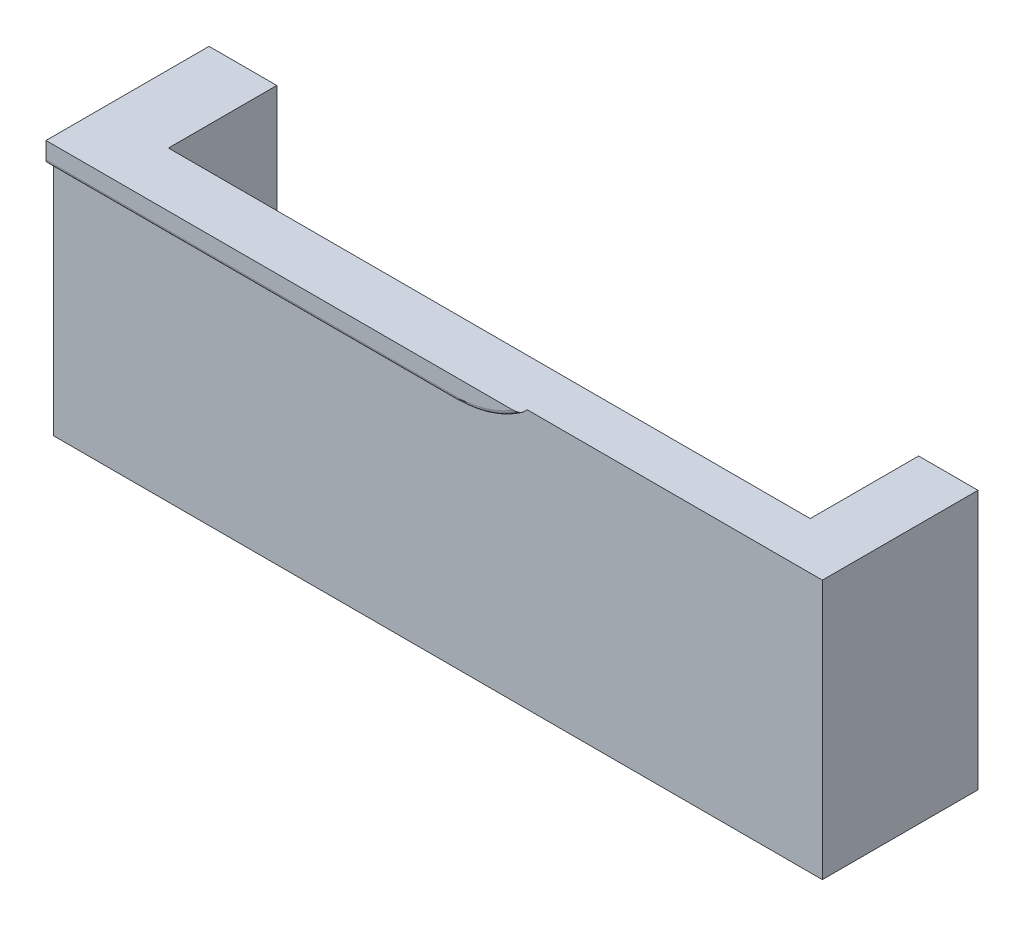
ISO-10303-21;
HEADER;
FILE_DESCRIPTION(('STEP AP214'),'2;1');
FILE_NAME('part.step','',(''),(''),'','','');
FILE_SCHEMA(('AUTOMOTIVE_DESIGN { 1 0 10303 214 1 1 1 1 }'));
ENDSEC;
DATA;
#1=APPLICATION_CONTEXT('core data for automotive mechanical design processes');
#2=APPLICATION_PROTOCOL_DEFINITION('international standard','automotive_design',2000,#1);
#3=PRODUCT_CONTEXT('',#1,'mechanical');
#4=PRODUCT('Part','Part','',(#3));
#5=PRODUCT_RELATED_PRODUCT_CATEGORY('part','',(#4));
#6=PRODUCT_DEFINITION_FORMATION('','',#4);
#7=PRODUCT_DEFINITION_CONTEXT('part definition',#1,'design');
#8=PRODUCT_DEFINITION('design','',#6,#7);
#9=PRODUCT_DEFINITION_SHAPE('','',#8);
#10=(LENGTH_UNIT() NAMED_UNIT(*) SI_UNIT(.MILLI.,.METRE.));
#11=(NAMED_UNIT(*) PLANE_ANGLE_UNIT() SI_UNIT($,.RADIAN.));
#12=(NAMED_UNIT(*) SI_UNIT($,.STERADIAN.) SOLID_ANGLE_UNIT());
#13=UNCERTAINTY_MEASURE_WITH_UNIT(LENGTH_MEASURE(1.E-05),#10,'distance_accuracy_value','');
#14=(GEOMETRIC_REPRESENTATION_CONTEXT(3) GLOBAL_UNCERTAINTY_ASSIGNED_CONTEXT((#13)) GLOBAL_UNIT_ASSIGNED_CONTEXT((#10,
#11,#12)) REPRESENTATION_CONTEXT('',''));
#15=CARTESIAN_POINT('',(0.,0.,0.));
#16=DIRECTION('',(0.,0.,1.));
#17=DIRECTION('',(1.,0.,0.));
#18=AXIS2_PLACEMENT_3D('',#15,#16,#17);
#19=CARTESIAN_POINT('',(-415.,-115.,-95.));
#20=DIRECTION('',(0.,-1.,0.));
#21=DIRECTION('',(0.,0.,-1.));
#22=AXIS2_PLACEMENT_3D('',#19,#20,#21);
#23=PLANE('',#22);
#24=DIRECTION('',(0.,0.,1.));
#25=VECTOR('',#24,1.);
#26=CARTESIAN_POINT('',(-207.5,-115.,53.));
#27=LINE('',#26,#25);
#28=CARTESIAN_POINT('',(-207.5,-115.,53.));
#29=VERTEX_POINT('',#28);
#30=CARTESIAN_POINT('',(-207.5,-115.,95.));
#31=VERTEX_POINT('',#30);
#32=EDGE_CURVE('E133',#29,#31,#27,.T.);
#33=ORIENTED_EDGE('',*,*,#32,.T.);
#34=DIRECTION('',(1.,0.,0.));
#35=VECTOR('',#34,1.);
#36=CARTESIAN_POINT('',(-415.,-115.,95.));
#37=LINE('',#36,#35);
#38=CARTESIAN_POINT('',(-415.,-115.,95.));
#39=VERTEX_POINT('',#38);
#40=EDGE_CURVE('E174',#39,#31,#37,.T.);
#41=ORIENTED_EDGE('',*,*,#40,.F.);
#42=DIRECTION('',(0.,0.,1.));
#43=VECTOR('',#42,1.);
#44=CARTESIAN_POINT('',(-415.,-115.,-95.));
#45=LINE('',#44,#43);
#46=CARTESIAN_POINT('',(-415.,-115.,53.));
#47=VERTEX_POINT('',#46);
#48=EDGE_CURVE('E172',#47,#39,#45,.T.);
#49=ORIENTED_EDGE('',*,*,#48,.F.);
#50=DIRECTION('',(-1.,0.,0.));
#51=VECTOR('',#50,1.);
#52=CARTESIAN_POINT('',(415.,-115.,53.));
#53=LINE('',#52,#51);
#54=CARTESIAN_POINT('',(-396.71416803599,-115.,53.));
#55=VERTEX_POINT('',#54);
#56=EDGE_CURVE('E150',#55,#47,#53,.T.);
#57=ORIENTED_EDGE('',*,*,#56,.F.);
#58=DIRECTION('',(0.,0.,1.));
#59=VECTOR('',#58,1.);
#60=CARTESIAN_POINT('',(-396.71416803599,-115.,0.));
#61=LINE('',#60,#59);
#62=CARTESIAN_POINT('',(-396.71416803599,-115.,82.2517643619484));
#63=VERTEX_POINT('',#62);
#64=EDGE_CURVE('E235',#55,#63,#61,.T.);
#65=ORIENTED_EDGE('',*,*,#64,.T.);
#66=DIRECTION('',(1.,0.,0.));
#67=VECTOR('',#66,1.);
#68=CARTESIAN_POINT('',(0.,-115.,82.2517643619484));
#69=LINE('',#68,#67);
#70=CARTESIAN_POINT('',(-223.524972097698,-115.,82.2517643619484));
#71=VERTEX_POINT('',#70);
#72=EDGE_CURVE('E229',#63,#71,#69,.T.);
#73=ORIENTED_EDGE('',*,*,#72,.T.);
#74=DIRECTION('',(0.,0.,1.));
#75=VECTOR('',#74,1.);
#76=CARTESIAN_POINT('',(-223.524972097698,-115.,0.));
#77=LINE('',#76,#75);
#78=CARTESIAN_POINT('',(-223.524972097698,-115.,53.));
#79=VERTEX_POINT('',#78);
#80=EDGE_CURVE('E227',#79,#71,#77,.T.);
#81=ORIENTED_EDGE('',*,*,#80,.F.);
#82=EDGE_CURVE('E153',#29,#79,#53,.T.);
#83=ORIENTED_EDGE('',*,*,#82,.F.);
#84=EDGE_LOOP('',(#33,#41,#49,#57,#65,#73,#81,#83));
#85=FACE_BOUND('',#84,.T.);
#86=ADVANCED_FACE('F40',(#85),#23,.T.);
#87=CARTESIAN_POINT('',(0.,0.,53.));
#88=DIRECTION('',(0.,0.,-1.));
#89=DIRECTION('',(-1.,0.,0.));
#90=AXIS2_PLACEMENT_3D('',#87,#88,#89);
#91=PLANE('',#90);
#92=DIRECTION('',(-1.,0.,0.));
#93=VECTOR('',#92,1.);
#94=CARTESIAN_POINT('',(0.,-45.,53.));
#95=LINE('',#94,#93);
#96=CARTESIAN_POINT('',(-396.71416803599,-45.,53.));
#97=VERTEX_POINT('',#96);
#98=CARTESIAN_POINT('',(-415.,-45.,53.));
#99=VERTEX_POINT('',#98);
#100=EDGE_CURVE('E151',#97,#99,#95,.T.);
#101=ORIENTED_EDGE('',*,*,#100,.F.);
#102=DIRECTION('',(0.,-1.,0.));
#103=VECTOR('',#102,1.);
#104=CARTESIAN_POINT('',(-396.71416803599,-45.,53.));
#105=LINE('',#104,#103);
#106=EDGE_CURVE('E243',#97,#55,#105,.T.);
#107=ORIENTED_EDGE('',*,*,#106,.T.);
#108=ORIENTED_EDGE('',*,*,#56,.T.);
#109=DIRECTION('',(0.,1.,0.));
#110=VECTOR('',#109,1.);
#111=CARTESIAN_POINT('',(-415.,115.,53.));
#112=LINE('',#111,#110);
#113=EDGE_CURVE('E163',#47,#99,#112,.T.);
#114=ORIENTED_EDGE('',*,*,#113,.T.);
#115=EDGE_LOOP('',(#101,#107,#108,#114));
#116=FACE_BOUND('',#115,.T.);
#117=ADVANCED_FACE('F262',(#116),#91,.T.);
#118=DIRECTION('',(0.,-1.,0.));
#119=VECTOR('',#118,1.);
#120=CARTESIAN_POINT('',(-207.5,-115.,53.));
#121=LINE('',#120,#119);
#122=CARTESIAN_POINT('',(-207.5,-45.,53.));
#123=VERTEX_POINT('',#122);
#124=EDGE_CURVE('E130',#123,#29,#121,.T.);
#125=ORIENTED_EDGE('',*,*,#124,.T.);
#126=ORIENTED_EDGE('',*,*,#82,.T.);
#127=DIRECTION('',(0.,-1.,0.));
#128=VECTOR('',#127,1.);
#129=CARTESIAN_POINT('',(-223.524972097698,-45.,53.));
#130=LINE('',#129,#128);
#131=CARTESIAN_POINT('',(-223.524972097698,-45.,53.));
#132=VERTEX_POINT('',#131);
#133=EDGE_CURVE('E149',#132,#79,#130,.T.);
#134=ORIENTED_EDGE('',*,*,#133,.F.);
#135=EDGE_CURVE('E142',#123,#132,#95,.T.);
#136=ORIENTED_EDGE('',*,*,#135,.F.);
#137=EDGE_LOOP('',(#125,#126,#134,#136));
#138=FACE_BOUND('',#137,.T.);
#139=ADVANCED_FACE('F147',(#138),#91,.T.);
#140=CARTESIAN_POINT('',(0.,-45.,97.));
#141=DIRECTION('',(0.,-1.,0.));
#142=DIRECTION('',(1.,0.,0.));
#143=AXIS2_PLACEMENT_3D('',#140,#141,#142);
#144=PLANE('',#143);
#145=DIRECTION('',(-1.,0.,0.));
#146=VECTOR('',#145,1.);
#147=CARTESIAN_POINT('',(0.,-45.,95.));
#148=LINE('',#147,#146);
#149=CARTESIAN_POINT('',(-207.5,-45.0000000000001,95.));
#150=VERTEX_POINT('',#149);
#151=CARTESIAN_POINT('',(-287.168474218365,-45.0000000000001,95.));
#152=VERTEX_POINT('',#151);
#153=EDGE_CURVE('E144',#150,#152,#148,.T.);
#154=ORIENTED_EDGE('',*,*,#153,.F.);
#155=DIRECTION('',(0.,0.,1.));
#156=VECTOR('',#155,1.);
#157=CARTESIAN_POINT('',(-207.5,-45.,53.));
#158=LINE('',#157,#156);
#159=EDGE_CURVE('E55',#123,#150,#158,.T.);
#160=ORIENTED_EDGE('',*,*,#159,.F.);
#161=ORIENTED_EDGE('',*,*,#135,.T.);
#162=DIRECTION('',(0.,0.,1.));
#163=VECTOR('',#162,1.);
#164=CARTESIAN_POINT('',(-223.524972097698,-45.,0.));
#165=LINE('',#164,#163);
#166=CARTESIAN_POINT('',(-223.524972097698,-45.0000000000001,82.2517643619484));
#167=VERTEX_POINT('',#166);
#168=EDGE_CURVE('E232',#132,#167,#165,.T.);
#169=ORIENTED_EDGE('',*,*,#168,.T.);
#170=DIRECTION('',(1.,0.,0.));
#171=VECTOR('',#170,1.);
#172=CARTESIAN_POINT('',(0.,-45.,82.2517643619484));
#173=LINE('',#172,#171);
#174=CARTESIAN_POINT('',(-396.71416803599,-45.,82.2517643619484));
#175=VERTEX_POINT('',#174);
#176=EDGE_CURVE('E234',#175,#167,#173,.T.);
#177=ORIENTED_EDGE('',*,*,#176,.F.);
#178=DIRECTION('',(0.,0.,1.));
#179=VECTOR('',#178,1.);
#180=CARTESIAN_POINT('',(-396.71416803599,-45.,0.));
#181=LINE('',#180,#179);
#182=EDGE_CURVE('E237',#97,#175,#181,.T.);
#183=ORIENTED_EDGE('',*,*,#182,.F.);
#184=ORIENTED_EDGE('',*,*,#100,.T.);
#185=DIRECTION('',(0.,0.,-1.));
#186=VECTOR('',#185,1.);
#187=CARTESIAN_POINT('',(-415.,-45.,97.));
#188=LINE('',#187,#186);
#189=CARTESIAN_POINT('',(-415.,-45.,97.));
#190=VERTEX_POINT('',#189);
#191=EDGE_CURVE('E253',#190,#99,#188,.T.);
#192=ORIENTED_EDGE('',*,*,#191,.F.);
#193=DIRECTION('',(-1.,0.,0.));
#194=VECTOR('',#193,1.);
#195=CARTESIAN_POINT('',(0.,-45.,97.));
#196=LINE('',#195,#194);
#197=CARTESIAN_POINT('',(-288.959221491246,-45.0000000000001,97.));
#198=VERTEX_POINT('',#197);
#199=EDGE_CURVE('E246',#198,#190,#196,.T.);
#200=ORIENTED_EDGE('',*,*,#199,.F.);
#201=CARTESIAN_POINT('',(-290.910908365606,-45.0000000000001,96.0074644361045));
#202=CARTESIAN_POINT('',(-290.910449066097,-45.0000000000001,96.0371609292349));
#203=CARTESIAN_POINT('',(-290.90724652384,-45.0000000000001,96.066856981842));
#204=CARTESIAN_POINT('',(-290.895687328839,-45.0000000000001,96.1252505575524));
#205=CARTESIAN_POINT('',(-290.88731799659,-45.0000000000001,96.1539454401594));
#206=CARTESIAN_POINT('',(-290.863585565672,-45.0000000000001,96.2165322142297));
#207=CARTESIAN_POINT('',(-290.847006187288,-45.0000000000001,96.249958927204));
#208=CARTESIAN_POINT('',(-290.808722078508,-45.0000000000001,96.3137039161092));
#209=CARTESIAN_POINT('',(-290.787008482495,-45.0000000000001,96.3440166836202));
#210=CARTESIAN_POINT('',(-290.725944825464,-45.0000000000001,96.4186057978333));
#211=CARTESIAN_POINT('',(-290.683759077482,-45.0000000000001,96.4605379166293));
#212=CARTESIAN_POINT('',(-290.593733720451,-45.0000000000001,96.5377573156316));
#213=CARTESIAN_POINT('',(-290.545879614325,-45.0000000000001,96.5730269319523));
#214=CARTESIAN_POINT('',(-290.449831650928,-45.0000000000001,96.63586522637));
#215=CARTESIAN_POINT('',(-290.401865016296,-45.0000000000001,96.6637868431411));
#216=CARTESIAN_POINT('',(-290.303724650762,-45.0000000000001,96.715484638578));
#217=CARTESIAN_POINT('',(-290.253549093208,-45.0000000000001,96.7392573024849));
#218=CARTESIAN_POINT('',(-290.151545852994,-45.0000000000001,96.7831947059222));
#219=CARTESIAN_POINT('',(-290.099715275619,-45.0000000000001,96.8033526641955));
#220=CARTESIAN_POINT('',(-289.994887947039,-45.0000000000001,96.8403847206207));
#221=CARTESIAN_POINT('',(-289.941890826764,-45.0000000000001,96.8572577623773));
#222=CARTESIAN_POINT('',(-289.798725000171,-45.0000000000001,96.8984312536566));
#223=CARTESIAN_POINT('',(-289.70776110726,-45.0000000000001,96.9199910879853));
#224=CARTESIAN_POINT('',(-289.524312003374,-45.0000000000001,96.9553903736165));
#225=CARTESIAN_POINT('',(-289.431825771173,-45.0000000000001,96.9692244052276));
#226=CARTESIAN_POINT('',(-289.245996870672,-45.0000000000001,96.989472083432));
#227=CARTESIAN_POINT('',(-289.152653767829,-45.0000000000001,96.9958817284681));
#228=CARTESIAN_POINT('',(-288.965789713717,-45.0000000000001,97.0012437645481));
#229=CARTESIAN_POINT('',(-288.872268874246,-45.0000000000001,97.0001998699273));
#230=CARTESIAN_POINT('',(-288.709354578749,-45.0000000000001,96.9915784062881));
#231=CARTESIAN_POINT('',(-288.639866941213,-45.0000000000001,96.9857279147146));
#232=CARTESIAN_POINT('',(-288.50143738558,-45.0000000000001,96.9694296143891));
#233=CARTESIAN_POINT('',(-288.432495350485,-45.0000000000001,96.9589828200273));
#234=CARTESIAN_POINT('',(-288.295719433356,-45.0000000000001,96.9331454394062));
#235=CARTESIAN_POINT('',(-288.227883115762,-45.0000000000001,96.9177679140539));
#236=CARTESIAN_POINT('',(-288.093711837223,-45.0000000000001,96.8815423506539));
#237=CARTESIAN_POINT('',(-288.027375958842,-45.0000000000001,96.860697759337));
#238=CARTESIAN_POINT('',(-287.89246634413,-45.0000000000001,96.8111766597478));
#239=CARTESIAN_POINT('',(-287.824051006543,-45.0000000000001,96.7820611629233));
#240=CARTESIAN_POINT('',(-287.691258651545,-45.0000000000001,96.7155753332751));
#241=CARTESIAN_POINT('',(-287.626880060838,-45.0000000000001,96.6782082424566));
#242=CARTESIAN_POINT('',(-287.519115360259,-45.0000000000001,96.6036624839677));
#243=CARTESIAN_POINT('',(-287.474348954556,-45.0000000000001,96.568498683919));
#244=CARTESIAN_POINT('',(-287.390652279424,-45.0000000000001,96.4917678261419));
#245=CARTESIAN_POINT('',(-287.351709913047,-45.0000000000001,96.4502144149643));
#246=CARTESIAN_POINT('',(-287.29319077656,-45.0000000000001,96.3742240726599));
#247=CARTESIAN_POINT('',(-287.271345612721,-45.0000000000001,96.3415450879777));
#248=CARTESIAN_POINT('',(-287.233063542104,-45.0000000000001,96.2731280725144));
#249=CARTESIAN_POINT('',(-287.216622614788,-45.0000000000001,96.2373923408897));
#250=CARTESIAN_POINT('',(-287.190335702172,-45.0000000000001,96.1630869745807));
#251=CARTESIAN_POINT('',(-287.180562091404,-45.0000000000001,96.1244911304652));
#252=CARTESIAN_POINT('',(-287.168980801408,-45.0000000000001,96.0461263697311));
#253=CARTESIAN_POINT('',(-287.167164386173,-45.0000000000001,96.006358787867));
#254=CARTESIAN_POINT('',(-287.171344637928,-45.0000000000001,95.9332531697049));
#255=CARTESIAN_POINT('',(-287.17621144678,-45.0000000000001,95.8998445387839));
#256=CARTESIAN_POINT('',(-287.191401943325,-45.0000000000001,95.8342986355963));
#257=CARTESIAN_POINT('',(-287.201728199879,-45.0000000000001,95.8021619694916));
#258=CARTESIAN_POINT('',(-287.230488090268,-45.0000000000001,95.7315097430546));
#259=CARTESIAN_POINT('',(-287.250349467848,-45.0000000000001,95.6935787827816));
#260=CARTESIAN_POINT('',(-287.295939876993,-45.0000000000001,95.6214393163258));
#261=CARTESIAN_POINT('',(-287.321679449644,-45.0000000000001,95.587237662528));
#262=CARTESIAN_POINT('',(-287.390850491901,-45.0000000000001,95.5072155276152));
#263=CARTESIAN_POINT('',(-287.4368623282,-45.0000000000001,95.4636413685783));
#264=CARTESIAN_POINT('',(-287.534972412806,-45.0000000000001,95.3840331179201));
#265=CARTESIAN_POINT('',(-287.587084408803,-45.0000000000001,95.3480165888742));
#266=CARTESIAN_POINT('',(-287.686440143131,-45.0000000000001,95.2879143247001));
#267=CARTESIAN_POINT('',(-287.733097823818,-45.0000000000001,95.2628408773864));
#268=CARTESIAN_POINT('',(-287.828410733058,-45.0000000000001,95.2168025420523));
#269=CARTESIAN_POINT('',(-287.877067267452,-45.0000000000001,95.1958403932568));
#270=CARTESIAN_POINT('',(-288.025266656524,-45.0000000000001,95.138423786093));
#271=CARTESIAN_POINT('',(-288.126964021434,-45.0000000000001,95.1074820057342));
#272=CARTESIAN_POINT('',(-288.314379279032,-45.0000000000001,95.0623743514877));
#273=CARTESIAN_POINT('',(-288.399642152494,-45.0000000000001,95.0461815813106));
#274=CARTESIAN_POINT('',(-288.57129393389,-45.0000000000001,95.0211123884201));
#275=CARTESIAN_POINT('',(-288.657683531994,-45.0000000000001,95.0122406867951));
#276=CARTESIAN_POINT('',(-288.831103174585,-45.0000000000001,95.0012527202666));
#277=CARTESIAN_POINT('',(-288.918134309792,-45.0000000000001,94.9991544273752));
#278=CARTESIAN_POINT('',(-289.092079902548,-45.0000000000001,95.0014519540541));
#279=CARTESIAN_POINT('',(-289.178994387974,-45.0000000000001,95.0058457533557));
#280=CARTESIAN_POINT('',(-289.355857800073,-45.0000000000001,95.0213622106065));
#281=CARTESIAN_POINT('',(-289.445783116449,-45.0000000000001,95.0327563221171));
#282=CARTESIAN_POINT('',(-289.624506464971,-45.0000000000001,95.0627067971799));
#283=CARTESIAN_POINT('',(-289.71330369443,-45.0000000000001,95.081267994622));
#284=CARTESIAN_POINT('',(-289.888774424533,-45.0000000000001,95.1260625693816));
#285=CARTESIAN_POINT('',(-289.975452008662,-45.0000000000001,95.1522796857311));
#286=CARTESIAN_POINT('',(-290.145584182983,-45.0000000000001,95.2134001085168));
#287=CARTESIAN_POINT('',(-290.229043723255,-45.0000000000001,95.2482894047154));
#288=CARTESIAN_POINT('',(-290.383446835631,-45.0000000000001,95.3249393013609));
#289=CARTESIAN_POINT('',(-290.454834633758,-45.0000000000001,95.3657685321645));
#290=CARTESIAN_POINT('',(-290.556158205368,-45.0000000000001,95.435091549284));
#291=CARTESIAN_POINT('',(-290.588901538825,-45.0000000000001,95.4594778445563));
#292=CARTESIAN_POINT('',(-290.65183124207,-45.0000000000001,95.5113283624264));
#293=CARTESIAN_POINT('',(-290.68202077734,-45.0000000000001,95.5387886735854));
#294=CARTESIAN_POINT('',(-290.735391426855,-45.0000000000001,95.5936183526221));
#295=CARTESIAN_POINT('',(-290.758978139042,-45.0000000000001,95.6205884949252));
#296=CARTESIAN_POINT('',(-290.802457194198,-45.0000000000001,95.6774517276167));
#297=CARTESIAN_POINT('',(-290.822346313006,-45.0000000000001,95.7073473345548));
#298=CARTESIAN_POINT('',(-290.857311606751,-45.0000000000001,95.7704530175437));
#299=CARTESIAN_POINT('',(-290.87231528482,-45.0000000000001,95.8037041962639));
#300=CARTESIAN_POINT('',(-290.895432948827,-45.0000000000001,95.8724774831922));
#301=CARTESIAN_POINT('',(-290.903577300505,-45.0000000000001,95.9079888258944));
#302=CARTESIAN_POINT('',(-290.908949052196,-45.0000000000001,95.9544433970754));
#303=CARTESIAN_POINT('',(-290.909824246136,-45.0000000000001,95.9650256383543));
#304=CARTESIAN_POINT('',(-290.91088607969,-45.0000000000001,95.9862267465817));
#305=CARTESIAN_POINT('',(-290.911072601067,-45.0000000000001,95.9968456195062));
#306=CARTESIAN_POINT('',(-290.910908365606,-45.0000000000001,96.0074644361045));
#307=B_SPLINE_CURVE_WITH_KNOTS('',3,(#201,#202,#203,#204,#205,#206,#207,#208,#209,#210,#211,
#212,#213,#214,#215,#216,#217,#218,#219,#220,#221,#222,#223,#224,#225,#226,#227,#228,#229,#230,
#231,#232,#233,#234,#235,#236,#237,#238,#239,#240,#241,#242,#243,#244,#245,#246,#247,#248,#249,
#250,#251,#252,#253,#254,#255,#256,#257,#258,#259,#260,#261,#262,#263,#264,#265,#266,#267,#268,
#269,#270,#271,#272,#273,#274,#275,#276,#277,#278,#279,#280,#281,#282,#283,#284,#285,#286,#287,
#288,#289,#290,#291,#292,#293,#294,#295,#296,#297,#298,#299,#300,#301,#302,#303,#304,#305,#306),
.UNSPECIFIED.,.T.,.F.,(4,2,2,2,2,2,2,2,2,2,2,2,2,2,2,2,2,2,2,2,2,2,2,2,2,2,2,2,2,2,2,2,2,2,2,2,
2,2,2,2,2,2,2,2,2,2,2,2,2,2,2,2,4),(0.,0.0890545501416905,0.17832851716039,0.289635180646539,
0.401135467223881,0.578578440109097,0.75648544941362,0.922748628909557,1.08915198063626,
1.255864314698,1.422630173499,1.70268022707519,1.98292649126075,2.263323730938,2.54358124952792,
2.75264636613742,2.96166536582641,3.17013521108611,3.37847394041673,3.60109686634594,
3.82363248010134,3.99392926049176,4.1638672573043,4.28139178035973,4.39882867090023,
4.51752089073897,4.63608276862909,4.73688050750689,4.83772571751239,4.96546639901063,
5.09343797597989,5.28249238664819,5.47198137609878,5.63066165567402,5.78944730228278,
6.1072756122591,6.3673399460755,6.62757185506946,6.88849367713828,7.14933432026654,
7.42099055261866,7.69283032630339,7.96409686767935,8.23492798398838,8.48076309261811,
8.6030967667695,8.725276513462,8.8325207578895,8.93985808102542,9.04872244055815,
9.15710229375788,9.18894078761916,9.22078474747819),.UNSPECIFIED.);
#308=CARTESIAN_POINT('',(-287.168474218365,-45.0000000000001,96.));
#309=VERTEX_POINT('',#308);
#310=EDGE_CURVE('E155',#198,#309,#307,.T.);
#311=ORIENTED_EDGE('',*,*,#310,.T.);
#312=DIRECTION('',(0.,0.,-1.));
#313=VECTOR('',#312,1.);
#314=CARTESIAN_POINT('',(-287.168474218365,-45.0000000000001,97.));
#315=LINE('',#314,#313);
#316=EDGE_CURVE('E255',#152,#309,#315,.F.);
#317=ORIENTED_EDGE('',*,*,#316,.F.);
#318=EDGE_LOOP('',(#154,#160,#161,#169,#177,#183,#184,#192,#200,#311,#317));
#319=FACE_BOUND('',#318,.T.);
#320=ADVANCED_FACE('F140',(#319),#144,.F.);
#321=CARTESIAN_POINT('',(-415.,-115.,-95.));
#322=DIRECTION('',(-1.,0.,0.));
#323=DIRECTION('',(0.,0.,1.));
#324=AXIS2_PLACEMENT_3D('',#321,#322,#323);
#325=PLANE('',#324);
#326=ORIENTED_EDGE('',*,*,#191,.T.);
#327=ORIENTED_EDGE('',*,*,#113,.F.);
#328=ORIENTED_EDGE('',*,*,#48,.T.);
#329=DIRECTION('',(0.,-1.,0.));
#330=VECTOR('',#329,1.);
#331=CARTESIAN_POINT('',(-415.,-115.,95.));
#332=LINE('',#331,#330);
#333=CARTESIAN_POINT('',(-415.,-50.5394233987774,95.));
#334=VERTEX_POINT('',#333);
#335=EDGE_CURVE('E177',#334,#39,#332,.T.);
#336=ORIENTED_EDGE('',*,*,#335,.F.);
#337=DIRECTION('',(0.,0.,-1.));
#338=VECTOR('',#337,1.);
#339=CARTESIAN_POINT('',(-415.,-50.539423398777,97.));
#340=LINE('',#339,#338);
#341=CARTESIAN_POINT('',(-415.,-50.539423398777,96.));
#342=VERTEX_POINT('',#341);
#343=EDGE_CURVE('E170',#342,#334,#340,.T.);
#344=ORIENTED_EDGE('',*,*,#343,.F.);
#345=CARTESIAN_POINT('',(-415.,-49.5394233987774,96.));
#346=DIRECTION('',(-1.,0.,0.));
#347=DIRECTION('',(0.,0.,1.));
#348=AXIS2_PLACEMENT_3D('',#345,#346,#347);
#349=CIRCLE('',#348,1.);
#350=CARTESIAN_POINT('',(-415.,-49.5394233987774,97.));
#351=VERTEX_POINT('',#350);
#352=EDGE_CURVE('E48',#342,#351,#349,.T.);
#353=ORIENTED_EDGE('',*,*,#352,.T.);
#354=DIRECTION('',(0.,-1.,0.));
#355=VECTOR('',#354,1.);
#356=CARTESIAN_POINT('',(-415.,-50.539423398777,97.));
#357=LINE('',#356,#355);
#358=EDGE_CURVE('E183',#190,#351,#357,.T.);
#359=ORIENTED_EDGE('',*,*,#358,.F.);
#360=EDGE_LOOP('',(#326,#327,#328,#336,#344,#353,#359));
#361=FACE_BOUND('',#360,.T.);
#362=ADVANCED_FACE('F216',(#361),#325,.T.);
#363=CARTESIAN_POINT('',(0.,0.,95.));
#364=DIRECTION('',(0.,0.,-1.));
#365=DIRECTION('',(-1.,0.,0.));
#366=AXIS2_PLACEMENT_3D('',#363,#364,#365);
#367=PLANE('',#366);
#368=ORIENTED_EDGE('',*,*,#40,.T.);
#369=DIRECTION('',(0.,1.,0.));
#370=VECTOR('',#369,1.);
#371=CARTESIAN_POINT('',(-207.5,0.,95.));
#372=LINE('',#371,#370);
#373=EDGE_CURVE('E12',#31,#150,#372,.T.);
#374=ORIENTED_EDGE('',*,*,#373,.T.);
#375=ORIENTED_EDGE('',*,*,#153,.T.);
#376=CARTESIAN_POINT('',(-304.537417546493,-20.5394233987774,95.));
#377=DIRECTION('',(0.,0.,-1.));
#378=DIRECTION('',(-1.,0.,0.));
#379=AXIS2_PLACEMENT_3D('',#376,#377,#378);
#380=CIRCLE('',#379,30.);
#381=CARTESIAN_POINT('',(-304.537417546493,-50.5394233987774,95.));
#382=VERTEX_POINT('',#381);
#383=EDGE_CURVE('E167',#382,#152,#380,.F.);
#384=ORIENTED_EDGE('',*,*,#383,.F.);
#385=DIRECTION('',(1.,0.,0.));
#386=VECTOR('',#385,1.);
#387=CARTESIAN_POINT('',(0.,-50.5394233987774,95.));
#388=LINE('',#387,#386);
#389=EDGE_CURVE('E180',#334,#382,#388,.T.);
#390=ORIENTED_EDGE('',*,*,#389,.F.);
#391=ORIENTED_EDGE('',*,*,#335,.T.);
#392=EDGE_LOOP('',(#368,#374,#375,#384,#390,#391));
#393=FACE_BOUND('',#392,.T.);
#394=ADVANCED_FACE('F222',(#393),#367,.F.);
#395=CARTESIAN_POINT('',(-304.537417546493,-20.5394233987774,97.));
#396=DIRECTION('',(0.,0.,-1.));
#397=DIRECTION('',(-1.,0.,0.));
#398=AXIS2_PLACEMENT_3D('',#395,#396,#397);
#399=CYLINDRICAL_SURFACE('',#398,30.);
#400=ORIENTED_EDGE('',*,*,#383,.T.);
#401=ORIENTED_EDGE('',*,*,#316,.T.);
#402=CARTESIAN_POINT('',(-304.537417546493,-20.5394233987774,96.));
#403=DIRECTION('',(0.,0.,-1.));
#404=DIRECTION('',(-1.,0.,0.));
#405=AXIS2_PLACEMENT_3D('',#402,#403,#404);
#406=CIRCLE('',#405,30.);
#407=CARTESIAN_POINT('',(-304.537417546493,-50.5394233987774,96.));
#408=VERTEX_POINT('',#407);
#409=EDGE_CURVE('E192',#309,#408,#406,.T.);
#410=ORIENTED_EDGE('',*,*,#409,.T.);
#411=DIRECTION('',(0.,0.,-1.));
#412=VECTOR('',#411,1.);
#413=CARTESIAN_POINT('',(-304.537417546493,-50.5394233987774,97.));
#414=LINE('',#413,#412);
#415=EDGE_CURVE('E171',#408,#382,#414,.T.);
#416=ORIENTED_EDGE('',*,*,#415,.T.);
#417=EDGE_LOOP('',(#400,#401,#410,#416));
#418=FACE_BOUND('',#417,.T.);
#419=ADVANCED_FACE('F291',(#418),#399,.T.);
#420=CARTESIAN_POINT('',(-414.956460907431,-50.5394233987774,97.));
#421=DIRECTION('',(0.,1.,0.));
#422=DIRECTION('',(0.,0.,1.));
#423=AXIS2_PLACEMENT_3D('',#420,#421,#422);
#424=PLANE('',#423);
#425=ORIENTED_EDGE('',*,*,#415,.F.);
#426=DIRECTION('',(1.,0.,0.));
#427=VECTOR('',#426,1.);
#428=CARTESIAN_POINT('',(-414.956460907431,-50.5394233987774,96.));
#429=LINE('',#428,#427);
#430=EDGE_CURVE('E194',#408,#342,#429,.F.);
#431=ORIENTED_EDGE('',*,*,#430,.T.);
#432=ORIENTED_EDGE('',*,*,#343,.T.);
#433=ORIENTED_EDGE('',*,*,#389,.T.);
#434=EDGE_LOOP('',(#425,#431,#432,#433));
#435=FACE_BOUND('',#434,.T.);
#436=ADVANCED_FACE('F211',(#435),#424,.F.);
#437=CARTESIAN_POINT('',(-304.537417546493,-20.5394233987774,97.));
#438=DIRECTION('',(0.,0.,-1.));
#439=DIRECTION('',(-1.,0.,0.));
#440=AXIS2_PLACEMENT_3D('',#437,#438,#439);
#441=PLANE('',#440);
#442=CARTESIAN_POINT('',(-304.537417546493,-20.5394233987774,97.));
#443=DIRECTION('',(0.,0.,-1.));
#444=DIRECTION('',(-1.,0.,0.));
#445=AXIS2_PLACEMENT_3D('',#442,#443,#444);
#446=CIRCLE('',#445,29.);
#447=CARTESIAN_POINT('',(-304.537417546493,-49.5394233987774,97.));
#448=VERTEX_POINT('',#447);
#449=EDGE_CURVE('E189',#448,#198,#446,.F.);
#450=ORIENTED_EDGE('',*,*,#449,.T.);
#451=ORIENTED_EDGE('',*,*,#199,.T.);
#452=ORIENTED_EDGE('',*,*,#358,.T.);
#453=DIRECTION('',(1.,0.,0.));
#454=VECTOR('',#453,1.);
#455=CARTESIAN_POINT('',(-304.537417546493,-49.5394233987774,97.));
#456=LINE('',#455,#454);
#457=EDGE_CURVE('E187',#351,#448,#456,.T.);
#458=ORIENTED_EDGE('',*,*,#457,.T.);
#459=EDGE_LOOP('',(#450,#451,#452,#458));
#460=FACE_BOUND('',#459,.T.);
#461=ADVANCED_FACE('F259',(#460),#441,.F.);
#462=CARTESIAN_POINT('',(-304.537417546493,-49.5394233987774,96.));
#463=DIRECTION('',(1.,0.,0.));
#464=DIRECTION('',(0.,0.,-1.));
#465=AXIS2_PLACEMENT_3D('',#462,#463,#464);
#466=CYLINDRICAL_SURFACE('',#465,1.);
#467=ORIENTED_EDGE('',*,*,#352,.F.);
#468=ORIENTED_EDGE('',*,*,#430,.F.);
#469=CARTESIAN_POINT('',(-304.537417546493,-49.5394233987774,96.));
#470=DIRECTION('',(1.,0.,0.));
#471=DIRECTION('',(0.,0.,-1.));
#472=AXIS2_PLACEMENT_3D('',#469,#470,#471);
#473=CIRCLE('',#472,1.);
#474=EDGE_CURVE('E166',#448,#408,#473,.T.);
#475=ORIENTED_EDGE('',*,*,#474,.F.);
#476=ORIENTED_EDGE('',*,*,#457,.F.);
#477=EDGE_LOOP('',(#467,#468,#475,#476));
#478=FACE_BOUND('',#477,.T.);
#479=ADVANCED_FACE('F42',(#478),#466,.T.);
#480=CARTESIAN_POINT('',(-304.537417546493,-20.5394233987774,96.));
#481=DIRECTION('',(0.,0.,-1.));
#482=DIRECTION('',(-1.,0.,0.));
#483=AXIS2_PLACEMENT_3D('',#480,#481,#482);
#484=TOROIDAL_SURFACE('',#483,29.,1.);
#485=ORIENTED_EDGE('',*,*,#310,.F.);
#486=ORIENTED_EDGE('',*,*,#449,.F.);
#487=ORIENTED_EDGE('',*,*,#474,.T.);
#488=ORIENTED_EDGE('',*,*,#409,.F.);
#489=EDGE_LOOP('',(#485,#486,#487,#488));
#490=FACE_BOUND('',#489,.T.);
#491=ADVANCED_FACE('F203',(#490),#484,.T.);
#492=CARTESIAN_POINT('',(-396.71416803599,-45.,0.));
#493=DIRECTION('',(1.,0.,0.));
#494=DIRECTION('',(0.,0.,-1.));
#495=AXIS2_PLACEMENT_3D('',#492,#493,#494);
#496=PLANE('',#495);
#497=ORIENTED_EDGE('',*,*,#64,.F.);
#498=ORIENTED_EDGE('',*,*,#106,.F.);
#499=ORIENTED_EDGE('',*,*,#182,.T.);
#500=DIRECTION('',(0.,-1.,0.));
#501=VECTOR('',#500,1.);
#502=CARTESIAN_POINT('',(-396.71416803599,-45.,82.2517643619484));
#503=LINE('',#502,#501);
#504=EDGE_CURVE('E247',#175,#63,#503,.T.);
#505=ORIENTED_EDGE('',*,*,#504,.T.);
#506=EDGE_LOOP('',(#497,#498,#499,#505));
#507=FACE_BOUND('',#506,.T.);
#508=ADVANCED_FACE('F265',(#507),#496,.T.);
#509=CARTESIAN_POINT('',(0.,-45.,82.2517643619484));
#510=DIRECTION('',(0.,0.,-1.));
#511=DIRECTION('',(-1.,0.,0.));
#512=AXIS2_PLACEMENT_3D('',#509,#510,#511);
#513=PLANE('',#512);
#514=ORIENTED_EDGE('',*,*,#72,.F.);
#515=ORIENTED_EDGE('',*,*,#504,.F.);
#516=ORIENTED_EDGE('',*,*,#176,.T.);
#517=DIRECTION('',(0.,-1.,0.));
#518=VECTOR('',#517,1.);
#519=CARTESIAN_POINT('',(-223.524972097698,-45.,82.2517643619484));
#520=LINE('',#519,#518);
#521=EDGE_CURVE('E62',#167,#71,#520,.T.);
#522=ORIENTED_EDGE('',*,*,#521,.T.);
#523=EDGE_LOOP('',(#514,#515,#516,#522));
#524=FACE_BOUND('',#523,.T.);
#525=ADVANCED_FACE('F270',(#524),#513,.T.);
#526=CARTESIAN_POINT('',(-223.524972097698,-45.,0.));
#527=DIRECTION('',(1.,0.,0.));
#528=DIRECTION('',(0.,0.,-1.));
#529=AXIS2_PLACEMENT_3D('',#526,#527,#528);
#530=PLANE('',#529);
#531=ORIENTED_EDGE('',*,*,#80,.T.);
#532=ORIENTED_EDGE('',*,*,#521,.F.);
#533=ORIENTED_EDGE('',*,*,#168,.F.);
#534=ORIENTED_EDGE('',*,*,#133,.T.);
#535=EDGE_LOOP('',(#531,#532,#533,#534));
#536=FACE_BOUND('',#535,.T.);
#537=ADVANCED_FACE('F271',(#536),#530,.F.);
#538=CARTESIAN_POINT('',(-207.5,-115.,53.));
#539=DIRECTION('',(-1.,0.,0.));
#540=DIRECTION('',(0.,0.,1.));
#541=AXIS2_PLACEMENT_3D('',#538,#539,#540);
#542=PLANE('',#541);
#543=ORIENTED_EDGE('',*,*,#32,.F.);
#544=ORIENTED_EDGE('',*,*,#124,.F.);
#545=ORIENTED_EDGE('',*,*,#159,.T.);
#546=ORIENTED_EDGE('',*,*,#373,.F.);
#547=EDGE_LOOP('',(#543,#544,#545,#546));
#548=FACE_BOUND('',#547,.T.);
#549=ADVANCED_FACE('F131',(#548),#542,.F.);
#550=CLOSED_SHELL('',(#86,#117,#139,#320,#362,#394,#419,#436,#461,#479,#491,#508,#525,#537,#549));
#551=MANIFOLD_SOLID_BREP('B2',#550);
#552=ADVANCED_BREP_SHAPE_REPRESENTATION('',(#18,#551),#14);
#553=SHAPE_DEFINITION_REPRESENTATION(#9,#552);
ENDSEC;
END-ISO-10303-21;
